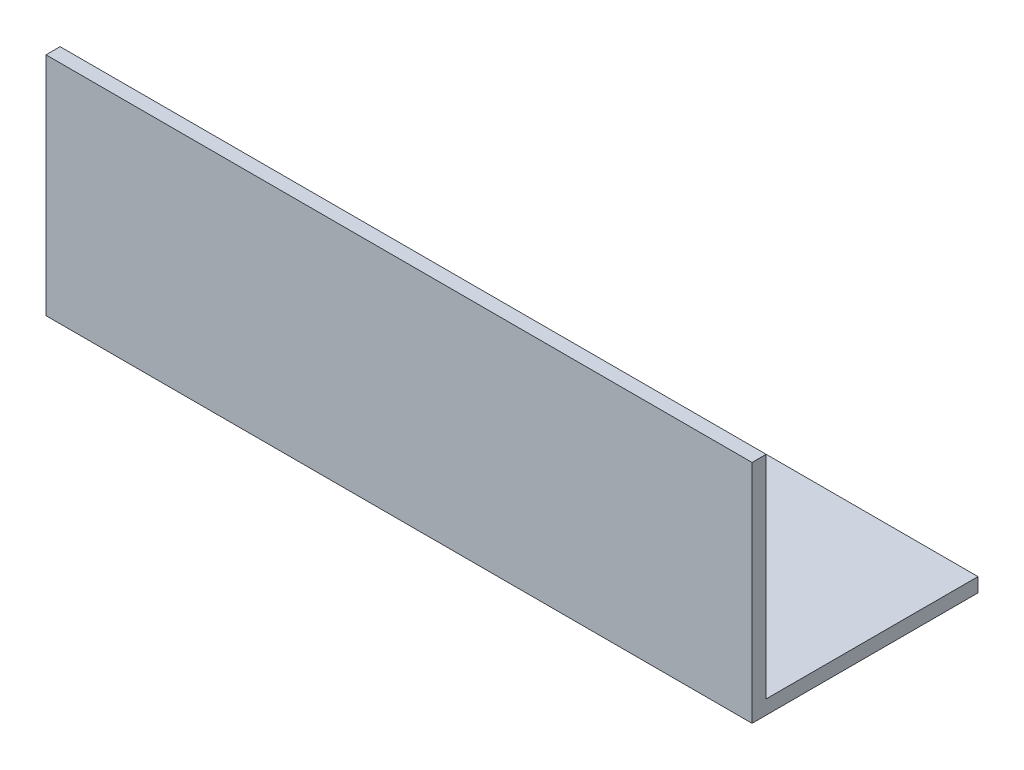
ISO-10303-21;
HEADER;
FILE_DESCRIPTION(('STEP AP214'),'2;1');
FILE_NAME('part.step','',(''),(''),'','','');
FILE_SCHEMA(('AUTOMOTIVE_DESIGN { 1 0 10303 214 1 1 1 1 }'));
ENDSEC;
DATA;
#1=APPLICATION_CONTEXT('core data for automotive mechanical design processes');
#2=APPLICATION_PROTOCOL_DEFINITION('international standard','automotive_design',2000,#1);
#3=PRODUCT_CONTEXT('',#1,'mechanical');
#4=PRODUCT('Part','Part','',(#3));
#5=PRODUCT_RELATED_PRODUCT_CATEGORY('part','',(#4));
#6=PRODUCT_DEFINITION_FORMATION('','',#4);
#7=PRODUCT_DEFINITION_CONTEXT('part definition',#1,'design');
#8=PRODUCT_DEFINITION('design','',#6,#7);
#9=PRODUCT_DEFINITION_SHAPE('','',#8);
#10=(LENGTH_UNIT() NAMED_UNIT(*) SI_UNIT(.MILLI.,.METRE.));
#11=(NAMED_UNIT(*) PLANE_ANGLE_UNIT() SI_UNIT($,.RADIAN.));
#12=(NAMED_UNIT(*) SI_UNIT($,.STERADIAN.) SOLID_ANGLE_UNIT());
#13=UNCERTAINTY_MEASURE_WITH_UNIT(LENGTH_MEASURE(1.E-05),#10,'distance_accuracy_value','');
#14=(GEOMETRIC_REPRESENTATION_CONTEXT(3) GLOBAL_UNCERTAINTY_ASSIGNED_CONTEXT((#13)) GLOBAL_UNIT_ASSIGNED_CONTEXT((#10,
#11,#12)) REPRESENTATION_CONTEXT('',''));
#15=CARTESIAN_POINT('',(0.,0.,0.));
#16=DIRECTION('',(0.,0.,1.));
#17=DIRECTION('',(1.,0.,0.));
#18=AXIS2_PLACEMENT_3D('',#15,#16,#17);
#19=CARTESIAN_POINT('',(150.,-3.,0.));
#20=DIRECTION('',(0.,1.,0.));
#21=DIRECTION('',(0.,0.,1.));
#22=AXIS2_PLACEMENT_3D('',#19,#20,#21);
#23=PLANE('',#22);
#24=DIRECTION('',(0.,0.,-1.));
#25=VECTOR('',#24,1.);
#26=CARTESIAN_POINT('',(0.,-3.,0.));
#27=LINE('',#26,#25);
#28=CARTESIAN_POINT('',(0.,-3.,3.));
#29=VERTEX_POINT('',#28);
#30=CARTESIAN_POINT('',(0.,-3.,-45.));
#31=VERTEX_POINT('',#30);
#32=EDGE_CURVE('E125',#29,#31,#27,.T.);
#33=ORIENTED_EDGE('',*,*,#32,.T.);
#34=DIRECTION('',(-1.,0.,0.));
#35=VECTOR('',#34,1.);
#36=CARTESIAN_POINT('',(150.,-3.,-45.));
#37=LINE('',#36,#35);
#38=CARTESIAN_POINT('',(150.,-3.,-45.));
#39=VERTEX_POINT('',#38);
#40=EDGE_CURVE('E11',#39,#31,#37,.T.);
#41=ORIENTED_EDGE('',*,*,#40,.F.);
#42=DIRECTION('',(0.,0.,-1.));
#43=VECTOR('',#42,1.);
#44=CARTESIAN_POINT('',(150.,-3.,0.));
#45=LINE('',#44,#43);
#46=CARTESIAN_POINT('',(150.,-3.,3.));
#47=VERTEX_POINT('',#46);
#48=EDGE_CURVE('E86',#47,#39,#45,.T.);
#49=ORIENTED_EDGE('',*,*,#48,.F.);
#50=DIRECTION('',(-1.,0.,0.));
#51=VECTOR('',#50,1.);
#52=CARTESIAN_POINT('',(150.,-3.,3.));
#53=LINE('',#52,#51);
#54=EDGE_CURVE('E121',#47,#29,#53,.T.);
#55=ORIENTED_EDGE('',*,*,#54,.T.);
#56=EDGE_LOOP('',(#33,#41,#49,#55));
#57=FACE_BOUND('',#56,.T.);
#58=ADVANCED_FACE('F39',(#57),#23,.F.);
#59=CARTESIAN_POINT('',(150.,0.,-45.));
#60=DIRECTION('',(0.,0.,-1.));
#61=DIRECTION('',(-1.,0.,0.));
#62=AXIS2_PLACEMENT_3D('',#59,#60,#61);
#63=PLANE('',#62);
#64=DIRECTION('',(0.,-1.,0.));
#65=VECTOR('',#64,1.);
#66=CARTESIAN_POINT('',(0.,0.,-45.));
#67=LINE('',#66,#65);
#68=CARTESIAN_POINT('',(0.,0.,-45.));
#69=VERTEX_POINT('',#68);
#70=EDGE_CURVE('E129',#69,#31,#67,.T.);
#71=ORIENTED_EDGE('',*,*,#70,.F.);
#72=DIRECTION('',(-1.,0.,0.));
#73=VECTOR('',#72,1.);
#74=CARTESIAN_POINT('',(150.,0.,-45.));
#75=LINE('',#74,#73);
#76=CARTESIAN_POINT('',(150.,0.,-45.));
#77=VERTEX_POINT('',#76);
#78=EDGE_CURVE('E48',#77,#69,#75,.T.);
#79=ORIENTED_EDGE('',*,*,#78,.F.);
#80=DIRECTION('',(0.,-1.,0.));
#81=VECTOR('',#80,1.);
#82=CARTESIAN_POINT('',(150.,0.,-45.));
#83=LINE('',#82,#81);
#84=EDGE_CURVE('E225',#77,#39,#83,.T.);
#85=ORIENTED_EDGE('',*,*,#84,.T.);
#86=ORIENTED_EDGE('',*,*,#40,.T.);
#87=EDGE_LOOP('',(#71,#79,#85,#86));
#88=FACE_BOUND('',#87,.T.);
#89=ADVANCED_FACE('F156',(#88),#63,.T.);
#90=CARTESIAN_POINT('',(150.,0.,0.));
#91=DIRECTION('',(0.,1.,0.));
#92=DIRECTION('',(0.,0.,1.));
#93=AXIS2_PLACEMENT_3D('',#90,#91,#92);
#94=PLANE('',#93);
#95=DIRECTION('',(0.,0.,-1.));
#96=VECTOR('',#95,1.);
#97=CARTESIAN_POINT('',(0.,0.,0.));
#98=LINE('',#97,#96);
#99=CARTESIAN_POINT('',(0.,0.,0.));
#100=VERTEX_POINT('',#99);
#101=EDGE_CURVE('E133',#100,#69,#98,.T.);
#102=ORIENTED_EDGE('',*,*,#101,.F.);
#103=DIRECTION('',(-1.,0.,0.));
#104=VECTOR('',#103,1.);
#105=CARTESIAN_POINT('',(150.,0.,0.));
#106=LINE('',#105,#104);
#107=CARTESIAN_POINT('',(150.,0.,0.));
#108=VERTEX_POINT('',#107);
#109=EDGE_CURVE('E108',#108,#100,#106,.T.);
#110=ORIENTED_EDGE('',*,*,#109,.F.);
#111=DIRECTION('',(0.,0.,-1.));
#112=VECTOR('',#111,1.);
#113=CARTESIAN_POINT('',(150.,0.,0.));
#114=LINE('',#113,#112);
#115=EDGE_CURVE('E114',#108,#77,#114,.T.);
#116=ORIENTED_EDGE('',*,*,#115,.T.);
#117=ORIENTED_EDGE('',*,*,#78,.T.);
#118=EDGE_LOOP('',(#102,#110,#116,#117));
#119=FACE_BOUND('',#118,.T.);
#120=ADVANCED_FACE('F153',(#119),#94,.T.);
#121=CARTESIAN_POINT('',(150.,45.,0.));
#122=DIRECTION('',(0.,0.,-1.));
#123=DIRECTION('',(0.,1.,0.));
#124=AXIS2_PLACEMENT_3D('',#121,#122,#123);
#125=PLANE('',#124);
#126=DIRECTION('',(0.,-1.,0.));
#127=VECTOR('',#126,1.);
#128=CARTESIAN_POINT('',(0.,45.,0.));
#129=LINE('',#128,#127);
#130=CARTESIAN_POINT('',(0.,45.,0.));
#131=VERTEX_POINT('',#130);
#132=EDGE_CURVE('E102',#131,#100,#129,.T.);
#133=ORIENTED_EDGE('',*,*,#132,.F.);
#134=DIRECTION('',(-1.,0.,0.));
#135=VECTOR('',#134,1.);
#136=CARTESIAN_POINT('',(150.,45.,0.));
#137=LINE('',#136,#135);
#138=CARTESIAN_POINT('',(150.,45.,0.));
#139=VERTEX_POINT('',#138);
#140=EDGE_CURVE('E97',#139,#131,#137,.T.);
#141=ORIENTED_EDGE('',*,*,#140,.F.);
#142=DIRECTION('',(0.,-1.,0.));
#143=VECTOR('',#142,1.);
#144=CARTESIAN_POINT('',(150.,45.,0.));
#145=LINE('',#144,#143);
#146=EDGE_CURVE('E100',#139,#108,#145,.T.);
#147=ORIENTED_EDGE('',*,*,#146,.T.);
#148=ORIENTED_EDGE('',*,*,#109,.T.);
#149=EDGE_LOOP('',(#133,#141,#147,#148));
#150=FACE_BOUND('',#149,.T.);
#151=ADVANCED_FACE('F99',(#150),#125,.T.);
#152=CARTESIAN_POINT('',(150.,45.,3.));
#153=DIRECTION('',(0.,1.,0.));
#154=DIRECTION('',(0.,0.,1.));
#155=AXIS2_PLACEMENT_3D('',#152,#153,#154);
#156=PLANE('',#155);
#157=DIRECTION('',(0.,0.,-1.));
#158=VECTOR('',#157,1.);
#159=CARTESIAN_POINT('',(0.,45.,3.));
#160=LINE('',#159,#158);
#161=CARTESIAN_POINT('',(0.,45.,3.));
#162=VERTEX_POINT('',#161);
#163=EDGE_CURVE('E139',#162,#131,#160,.T.);
#164=ORIENTED_EDGE('',*,*,#163,.F.);
#165=DIRECTION('',(-1.,0.,0.));
#166=VECTOR('',#165,1.);
#167=CARTESIAN_POINT('',(150.,45.,3.));
#168=LINE('',#167,#166);
#169=CARTESIAN_POINT('',(150.,45.,3.));
#170=VERTEX_POINT('',#169);
#171=EDGE_CURVE('E77',#170,#162,#168,.T.);
#172=ORIENTED_EDGE('',*,*,#171,.F.);
#173=DIRECTION('',(0.,0.,-1.));
#174=VECTOR('',#173,1.);
#175=CARTESIAN_POINT('',(150.,45.,3.));
#176=LINE('',#175,#174);
#177=EDGE_CURVE('E112',#170,#139,#176,.T.);
#178=ORIENTED_EDGE('',*,*,#177,.T.);
#179=ORIENTED_EDGE('',*,*,#140,.T.);
#180=EDGE_LOOP('',(#164,#172,#178,#179));
#181=FACE_BOUND('',#180,.T.);
#182=ADVANCED_FACE('F117',(#181),#156,.T.);
#183=CARTESIAN_POINT('',(150.,45.,3.));
#184=DIRECTION('',(0.,0.,-1.));
#185=DIRECTION('',(0.,1.,0.));
#186=AXIS2_PLACEMENT_3D('',#183,#184,#185);
#187=PLANE('',#186);
#188=DIRECTION('',(0.,-1.,0.));
#189=VECTOR('',#188,1.);
#190=CARTESIAN_POINT('',(0.,45.,3.));
#191=LINE('',#190,#189);
#192=EDGE_CURVE('E80',#162,#29,#191,.T.);
#193=ORIENTED_EDGE('',*,*,#192,.T.);
#194=ORIENTED_EDGE('',*,*,#54,.F.);
#195=DIRECTION('',(0.,-1.,0.));
#196=VECTOR('',#195,1.);
#197=CARTESIAN_POINT('',(150.,45.,3.));
#198=LINE('',#197,#196);
#199=EDGE_CURVE('E56',#170,#47,#198,.T.);
#200=ORIENTED_EDGE('',*,*,#199,.F.);
#201=ORIENTED_EDGE('',*,*,#171,.T.);
#202=EDGE_LOOP('',(#193,#194,#200,#201));
#203=FACE_BOUND('',#202,.T.);
#204=ADVANCED_FACE('F161',(#203),#187,.F.);
#205=CARTESIAN_POINT('',(150.,0.,0.));
#206=DIRECTION('',(-1.,0.,0.));
#207=DIRECTION('',(0.,0.,1.));
#208=AXIS2_PLACEMENT_3D('',#205,#206,#207);
#209=PLANE('',#208);
#210=ORIENTED_EDGE('',*,*,#48,.T.);
#211=ORIENTED_EDGE('',*,*,#84,.F.);
#212=ORIENTED_EDGE('',*,*,#115,.F.);
#213=ORIENTED_EDGE('',*,*,#146,.F.);
#214=ORIENTED_EDGE('',*,*,#177,.F.);
#215=ORIENTED_EDGE('',*,*,#199,.T.);
#216=EDGE_LOOP('',(#210,#211,#212,#213,#214,#215));
#217=FACE_BOUND('',#216,.T.);
#218=ADVANCED_FACE('F111',(#217),#209,.F.);
#219=CARTESIAN_POINT('',(0.,0.,0.));
#220=DIRECTION('',(-1.,0.,0.));
#221=DIRECTION('',(0.,0.,1.));
#222=AXIS2_PLACEMENT_3D('',#219,#220,#221);
#223=PLANE('',#222);
#224=ORIENTED_EDGE('',*,*,#32,.F.);
#225=ORIENTED_EDGE('',*,*,#192,.F.);
#226=ORIENTED_EDGE('',*,*,#163,.T.);
#227=ORIENTED_EDGE('',*,*,#132,.T.);
#228=ORIENTED_EDGE('',*,*,#101,.T.);
#229=ORIENTED_EDGE('',*,*,#70,.T.);
#230=EDGE_LOOP('',(#224,#225,#226,#227,#228,#229));
#231=FACE_BOUND('',#230,.T.);
#232=ADVANCED_FACE('F159',(#231),#223,.T.);
#233=CLOSED_SHELL('',(#58,#89,#120,#151,#182,#204,#218,#232));
#234=MANIFOLD_SOLID_BREP('B2',#233);
#235=ADVANCED_BREP_SHAPE_REPRESENTATION('',(#18,#234),#14);
#236=SHAPE_DEFINITION_REPRESENTATION(#9,#235);
ENDSEC;
END-ISO-10303-21;
